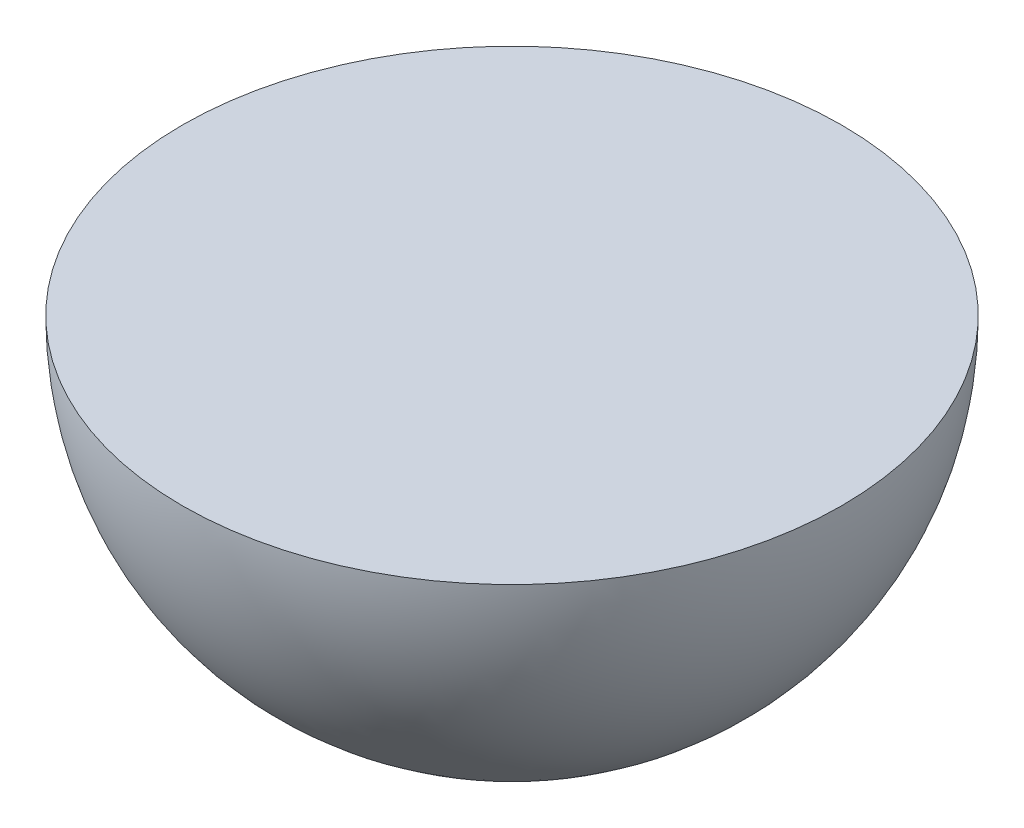
ISO-10303-21;
HEADER;
FILE_DESCRIPTION(('STEP AP214'),'2;1');
FILE_NAME('part.step','',(''),(''),'','','');
FILE_SCHEMA(('AUTOMOTIVE_DESIGN { 1 0 10303 214 1 1 1 1 }'));
ENDSEC;
DATA;
#1=APPLICATION_CONTEXT('core data for automotive mechanical design processes');
#2=APPLICATION_PROTOCOL_DEFINITION('international standard','automotive_design',2000,#1);
#3=PRODUCT_CONTEXT('',#1,'mechanical');
#4=PRODUCT('Part','Part','',(#3));
#5=PRODUCT_RELATED_PRODUCT_CATEGORY('part','',(#4));
#6=PRODUCT_DEFINITION_FORMATION('','',#4);
#7=PRODUCT_DEFINITION_CONTEXT('part definition',#1,'design');
#8=PRODUCT_DEFINITION('design','',#6,#7);
#9=PRODUCT_DEFINITION_SHAPE('','',#8);
#10=(LENGTH_UNIT() NAMED_UNIT(*) SI_UNIT(.MILLI.,.METRE.));
#11=(NAMED_UNIT(*) PLANE_ANGLE_UNIT() SI_UNIT($,.RADIAN.));
#12=(NAMED_UNIT(*) SI_UNIT($,.STERADIAN.) SOLID_ANGLE_UNIT());
#13=UNCERTAINTY_MEASURE_WITH_UNIT(LENGTH_MEASURE(1.E-05),#10,'distance_accuracy_value','');
#14=(GEOMETRIC_REPRESENTATION_CONTEXT(3) GLOBAL_UNCERTAINTY_ASSIGNED_CONTEXT((#13)) GLOBAL_UNIT_ASSIGNED_CONTEXT((#10,
#11,#12)) REPRESENTATION_CONTEXT('',''));
#15=CARTESIAN_POINT('',(0.,0.,0.));
#16=DIRECTION('',(0.,0.,1.));
#17=DIRECTION('',(1.,0.,0.));
#18=AXIS2_PLACEMENT_3D('',#15,#16,#17);
#19=CARTESIAN_POINT('',(-4.8,0.,0.));
#20=DIRECTION('',(0.,1.,0.));
#21=DIRECTION('',(0.,0.,1.));
#22=AXIS2_PLACEMENT_3D('',#19,#20,#21);
#23=PLANE('',#22);
#24=CARTESIAN_POINT('',(0.,0.,0.));
#25=DIRECTION('',(0.,1.,0.));
#26=DIRECTION('',(0.,0.,1.));
#27=AXIS2_PLACEMENT_3D('',#24,#25,#26);
#28=CIRCLE('',#27,4.8);
#29=CARTESIAN_POINT('',(0.,0.,4.8));
#30=VERTEX_POINT('',#29);
#31=EDGE_CURVE('E10',#30,#30,#28,.T.);
#32=ORIENTED_EDGE('',*,*,#31,.T.);
#33=EDGE_LOOP('',(#32));
#34=FACE_BOUND('',#33,.T.);
#35=ADVANCED_FACE('F31',(#34),#23,.T.);
#36=CARTESIAN_POINT('',(0.,0.,0.));
#37=DIRECTION('',(0.,1.,0.));
#38=DIRECTION('',(-1.,0.,0.));
#39=AXIS2_PLACEMENT_3D('',#36,#37,#38);
#40=SPHERICAL_SURFACE('',#39,4.8);
#41=ORIENTED_EDGE('',*,*,#31,.F.);
#42=EDGE_LOOP('',(#41));
#43=FACE_BOUND('',#42,.T.);
#44=ADVANCED_FACE('F39',(#43),#40,.T.);
#45=CLOSED_SHELL('',(#35,#44));
#46=MANIFOLD_SOLID_BREP('B2',#45);
#47=ADVANCED_BREP_SHAPE_REPRESENTATION('',(#18,#46),#14);
#48=SHAPE_DEFINITION_REPRESENTATION(#9,#47);
ENDSEC;
END-ISO-10303-21;
